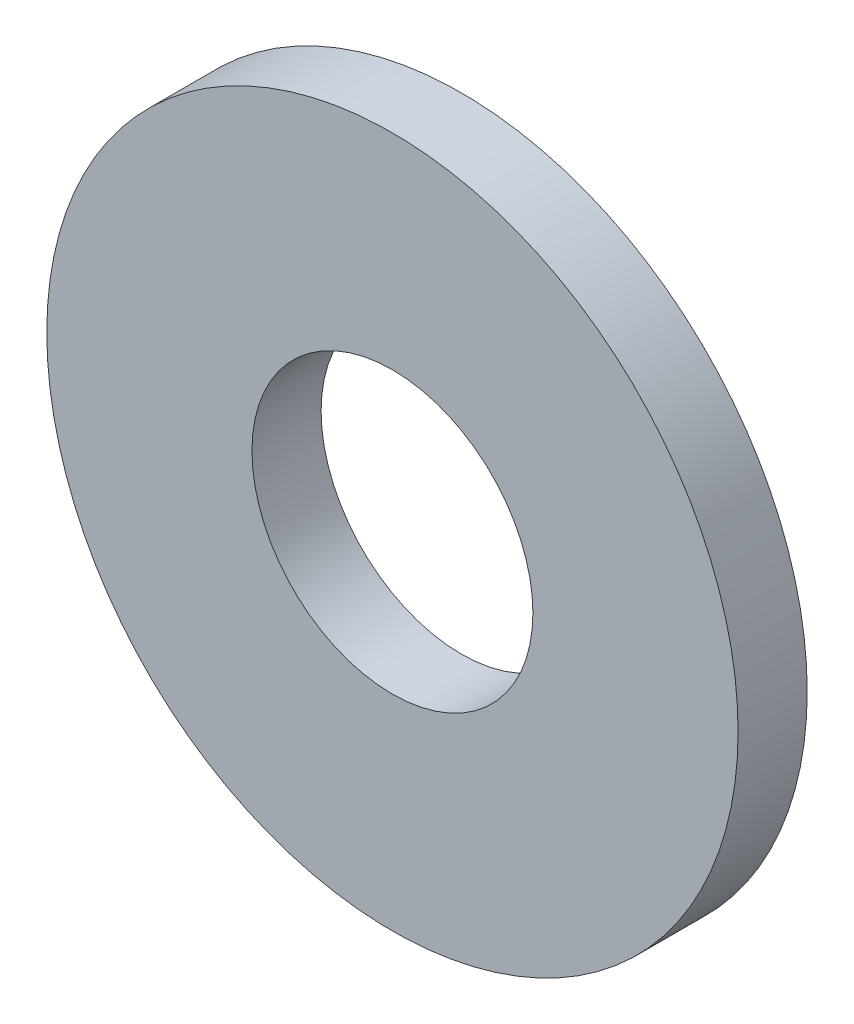
ISO-10303-21;
HEADER;
FILE_DESCRIPTION(('STEP AP214'),'2;1');
FILE_NAME('part.step','',(''),(''),'','','');
FILE_SCHEMA(('AUTOMOTIVE_DESIGN { 1 0 10303 214 1 1 1 1 }'));
ENDSEC;
DATA;
#1=APPLICATION_CONTEXT('core data for automotive mechanical design processes');
#2=APPLICATION_PROTOCOL_DEFINITION('international standard','automotive_design',2000,#1);
#3=PRODUCT_CONTEXT('',#1,'mechanical');
#4=PRODUCT('Part','Part','',(#3));
#5=PRODUCT_RELATED_PRODUCT_CATEGORY('part','',(#4));
#6=PRODUCT_DEFINITION_FORMATION('','',#4);
#7=PRODUCT_DEFINITION_CONTEXT('part definition',#1,'design');
#8=PRODUCT_DEFINITION('design','',#6,#7);
#9=PRODUCT_DEFINITION_SHAPE('','',#8);
#10=(LENGTH_UNIT() NAMED_UNIT(*) SI_UNIT(.MILLI.,.METRE.));
#11=(NAMED_UNIT(*) PLANE_ANGLE_UNIT() SI_UNIT($,.RADIAN.));
#12=(NAMED_UNIT(*) SI_UNIT($,.STERADIAN.) SOLID_ANGLE_UNIT());
#13=UNCERTAINTY_MEASURE_WITH_UNIT(LENGTH_MEASURE(1.E-05),#10,'distance_accuracy_value','');
#14=(GEOMETRIC_REPRESENTATION_CONTEXT(3) GLOBAL_UNCERTAINTY_ASSIGNED_CONTEXT((#13)) GLOBAL_UNIT_ASSIGNED_CONTEXT((#10,
#11,#12)) REPRESENTATION_CONTEXT('',''));
#15=CARTESIAN_POINT('',(0.,0.,0.));
#16=DIRECTION('',(0.,0.,1.));
#17=DIRECTION('',(1.,0.,0.));
#18=AXIS2_PLACEMENT_3D('',#15,#16,#17);
#19=CARTESIAN_POINT('',(0.,0.,0.79375));
#20=DIRECTION('',(0.,0.,1.));
#21=DIRECTION('',(1.,0.,0.));
#22=AXIS2_PLACEMENT_3D('',#19,#20,#21);
#23=PLANE('',#22);
#24=CARTESIAN_POINT('',(0.,0.,0.79375));
#25=DIRECTION('',(0.,0.,1.));
#26=DIRECTION('',(1.,0.,0.));
#27=AXIS2_PLACEMENT_3D('',#24,#25,#26);
#28=CIRCLE('',#27,7.9375);
#29=CARTESIAN_POINT('',(7.9375,0.,0.79375));
#30=VERTEX_POINT('',#29);
#31=EDGE_CURVE('E10',#30,#30,#28,.T.);
#32=ORIENTED_EDGE('',*,*,#31,.T.);
#33=EDGE_LOOP('',(#32));
#34=FACE_BOUND('',#33,.T.);
#35=CARTESIAN_POINT('',(0.,0.,0.79375));
#36=DIRECTION('',(0.,0.,1.));
#37=DIRECTION('',(1.,0.,0.));
#38=AXIS2_PLACEMENT_3D('',#35,#36,#37);
#39=CIRCLE('',#38,3.2258);
#40=CARTESIAN_POINT('',(3.2258,0.,0.79375));
#41=VERTEX_POINT('',#40);
#42=EDGE_CURVE('E45',#41,#41,#39,.T.);
#43=ORIENTED_EDGE('',*,*,#42,.F.);
#44=EDGE_LOOP('',(#43));
#45=FACE_BOUND('',#44,.T.);
#46=ADVANCED_FACE('F34',(#34,#45),#23,.T.);
#47=CARTESIAN_POINT('',(0.,0.,-0.79375));
#48=DIRECTION('',(0.,0.,1.));
#49=DIRECTION('',(1.,0.,0.));
#50=AXIS2_PLACEMENT_3D('',#47,#48,#49);
#51=PLANE('',#50);
#52=CARTESIAN_POINT('',(0.,0.,-0.79375));
#53=DIRECTION('',(0.,0.,1.));
#54=DIRECTION('',(1.,0.,0.));
#55=AXIS2_PLACEMENT_3D('',#52,#53,#54);
#56=CIRCLE('',#55,7.9375);
#57=CARTESIAN_POINT('',(7.9375,0.,-0.79375));
#58=VERTEX_POINT('',#57);
#59=EDGE_CURVE('E38',#58,#58,#56,.T.);
#60=ORIENTED_EDGE('',*,*,#59,.F.);
#61=EDGE_LOOP('',(#60));
#62=FACE_BOUND('',#61,.T.);
#63=CARTESIAN_POINT('',(0.,0.,-0.79375));
#64=DIRECTION('',(0.,0.,1.));
#65=DIRECTION('',(1.,0.,0.));
#66=AXIS2_PLACEMENT_3D('',#63,#64,#65);
#67=CIRCLE('',#66,3.2258);
#68=CARTESIAN_POINT('',(3.2258,0.,-0.79375));
#69=VERTEX_POINT('',#68);
#70=EDGE_CURVE('E47',#69,#69,#67,.T.);
#71=ORIENTED_EDGE('',*,*,#70,.T.);
#72=EDGE_LOOP('',(#71));
#73=FACE_BOUND('',#72,.T.);
#74=ADVANCED_FACE('F57',(#62,#73),#51,.F.);
#75=CARTESIAN_POINT('',(0.,0.,0.79375));
#76=DIRECTION('',(0.,0.,-1.));
#77=DIRECTION('',(-1.,0.,0.));
#78=AXIS2_PLACEMENT_3D('',#75,#76,#77);
#79=CYLINDRICAL_SURFACE('',#78,7.9375);
#80=ORIENTED_EDGE('',*,*,#31,.F.);
#81=EDGE_LOOP('',(#80));
#82=FACE_BOUND('',#81,.T.);
#83=ORIENTED_EDGE('',*,*,#59,.T.);
#84=EDGE_LOOP('',(#83));
#85=FACE_BOUND('',#84,.T.);
#86=ADVANCED_FACE('F36',(#82,#85),#79,.T.);
#87=CARTESIAN_POINT('',(0.,0.,0.79375));
#88=DIRECTION('',(0.,0.,-1.));
#89=DIRECTION('',(-1.,0.,0.));
#90=AXIS2_PLACEMENT_3D('',#87,#88,#89);
#91=CYLINDRICAL_SURFACE('',#90,3.2258);
#92=ORIENTED_EDGE('',*,*,#42,.T.);
#93=EDGE_LOOP('',(#92));
#94=FACE_BOUND('',#93,.T.);
#95=ORIENTED_EDGE('',*,*,#70,.F.);
#96=EDGE_LOOP('',(#95));
#97=FACE_BOUND('',#96,.T.);
#98=ADVANCED_FACE('F53',(#94,#97),#91,.F.);
#99=CLOSED_SHELL('',(#46,#74,#86,#98));
#100=MANIFOLD_SOLID_BREP('B2',#99);
#101=ADVANCED_BREP_SHAPE_REPRESENTATION('',(#18,#100),#14);
#102=SHAPE_DEFINITION_REPRESENTATION(#9,#101);
ENDSEC;
END-ISO-10303-21;
